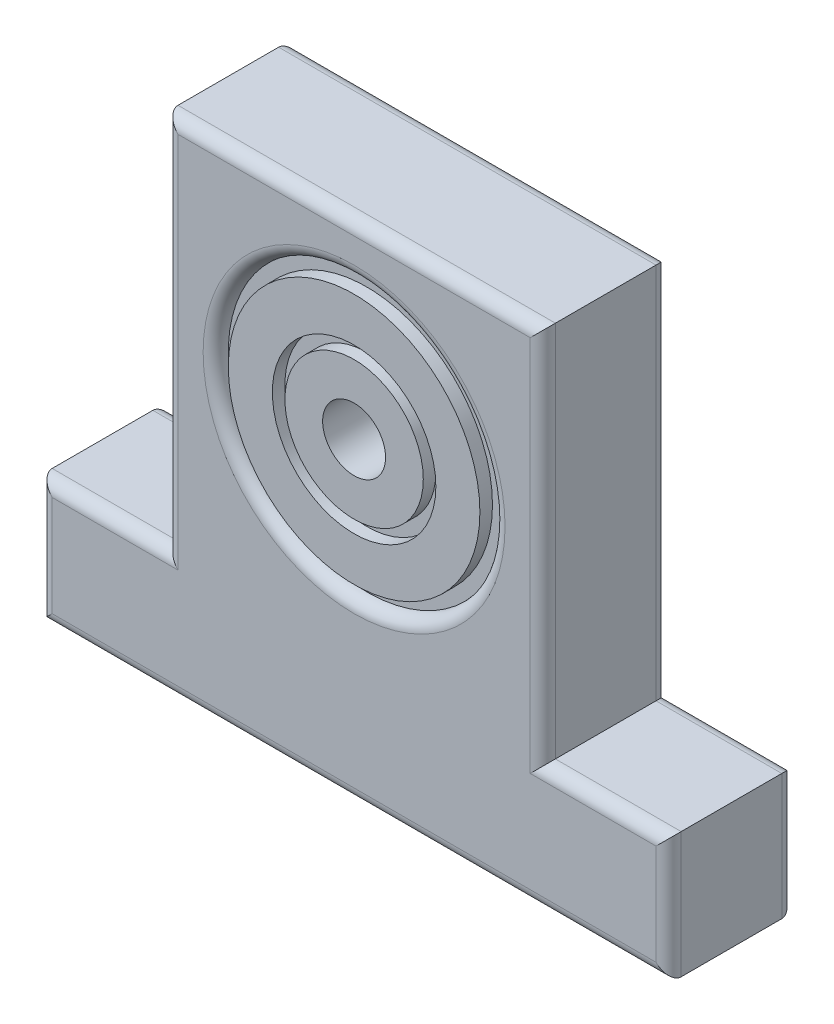
ISO-10303-21;
HEADER;
FILE_DESCRIPTION(('STEP AP214'),'2;1');
FILE_NAME('part.step','',(''),(''),'','','');
FILE_SCHEMA(('AUTOMOTIVE_DESIGN { 1 0 10303 214 1 1 1 1 }'));
ENDSEC;
DATA;
#1=APPLICATION_CONTEXT('core data for automotive mechanical design processes');
#2=APPLICATION_PROTOCOL_DEFINITION('international standard','automotive_design',2000,#1);
#3=PRODUCT_CONTEXT('',#1,'mechanical');
#4=PRODUCT('Part','Part','',(#3));
#5=PRODUCT_RELATED_PRODUCT_CATEGORY('part','',(#4));
#6=PRODUCT_DEFINITION_FORMATION('','',#4);
#7=PRODUCT_DEFINITION_CONTEXT('part definition',#1,'design');
#8=PRODUCT_DEFINITION('design','',#6,#7);
#9=PRODUCT_DEFINITION_SHAPE('','',#8);
#10=(LENGTH_UNIT() NAMED_UNIT(*) SI_UNIT(.MILLI.,.METRE.));
#11=(NAMED_UNIT(*) PLANE_ANGLE_UNIT() SI_UNIT($,.RADIAN.));
#12=(NAMED_UNIT(*) SI_UNIT($,.STERADIAN.) SOLID_ANGLE_UNIT());
#13=UNCERTAINTY_MEASURE_WITH_UNIT(LENGTH_MEASURE(1.E-05),#10,'distance_accuracy_value','');
#14=(GEOMETRIC_REPRESENTATION_CONTEXT(3) GLOBAL_UNCERTAINTY_ASSIGNED_CONTEXT((#13)) GLOBAL_UNIT_ASSIGNED_CONTEXT((#10,
#11,#12)) REPRESENTATION_CONTEXT('',''));
#15=CARTESIAN_POINT('',(0.,0.,0.));
#16=DIRECTION('',(0.,0.,1.));
#17=DIRECTION('',(1.,0.,0.));
#18=AXIS2_PLACEMENT_3D('',#15,#16,#17);
#19=CARTESIAN_POINT('',(0.,0.,0.));
#20=DIRECTION('',(0.,0.,1.));
#21=DIRECTION('',(1.,0.,0.));
#22=AXIS2_PLACEMENT_3D('',#19,#20,#21);
#23=PLANE('',#22);
#24=CARTESIAN_POINT('',(25.,25.,0.));
#25=DIRECTION('',(0.,0.,1.));
#26=DIRECTION('',(1.,0.,0.));
#27=AXIS2_PLACEMENT_3D('',#24,#25,#26);
#28=CIRCLE('',#27,2.5);
#29=CARTESIAN_POINT('',(27.5,25.,0.));
#30=VERTEX_POINT('',#29);
#31=EDGE_CURVE('E418',#30,#30,#28,.T.);
#32=ORIENTED_EDGE('',*,*,#31,.T.);
#33=EDGE_LOOP('',(#32));
#34=FACE_BOUND('',#33,.T.);
#35=CARTESIAN_POINT('',(25.,25.,0.));
#36=DIRECTION('',(0.,0.,1.));
#37=DIRECTION('',(1.,0.,0.));
#38=AXIS2_PLACEMENT_3D('',#35,#36,#37);
#39=CIRCLE('',#38,5.5);
#40=CARTESIAN_POINT('',(30.5,25.,0.));
#41=VERTEX_POINT('',#40);
#42=EDGE_CURVE('E459',#41,#41,#39,.T.);
#43=ORIENTED_EDGE('',*,*,#42,.F.);
#44=EDGE_LOOP('',(#43));
#45=FACE_BOUND('',#44,.T.);
#46=ADVANCED_FACE('F77',(#34,#45),#23,.F.);
#47=CARTESIAN_POINT('',(0.,0.,10.));
#48=DIRECTION('',(0.,0.,1.));
#49=DIRECTION('',(1.,0.,0.));
#50=AXIS2_PLACEMENT_3D('',#47,#48,#49);
#51=PLANE('',#50);
#52=CARTESIAN_POINT('',(25.,25.,10.));
#53=DIRECTION('',(0.,0.,1.));
#54=DIRECTION('',(1.,0.,0.));
#55=AXIS2_PLACEMENT_3D('',#52,#53,#54);
#56=CIRCLE('',#55,2.5);
#57=CARTESIAN_POINT('',(27.5,25.,10.));
#58=VERTEX_POINT('',#57);
#59=EDGE_CURVE('E417',#58,#58,#56,.T.);
#60=ORIENTED_EDGE('',*,*,#59,.F.);
#61=EDGE_LOOP('',(#60));
#62=FACE_BOUND('',#61,.T.);
#63=CARTESIAN_POINT('',(25.,25.,10.));
#64=DIRECTION('',(0.,0.,1.));
#65=DIRECTION('',(1.,0.,0.));
#66=AXIS2_PLACEMENT_3D('',#63,#64,#65);
#67=CIRCLE('',#66,5.5);
#68=CARTESIAN_POINT('',(30.5,25.,10.));
#69=VERTEX_POINT('',#68);
#70=EDGE_CURVE('E431',#69,#69,#67,.T.);
#71=ORIENTED_EDGE('',*,*,#70,.T.);
#72=EDGE_LOOP('',(#71));
#73=FACE_BOUND('',#72,.T.);
#74=ADVANCED_FACE('F508',(#62,#73),#51,.T.);
#75=DIRECTION('',(0.,-1.,0.));
#76=VECTOR('',#75,1.);
#77=CARTESIAN_POINT('',(11.,9.99999999999999,10.));
#78=LINE('',#77,#76);
#79=CARTESIAN_POINT('',(11.,39.,10.));
#80=VERTEX_POINT('',#79);
#81=CARTESIAN_POINT('',(11.,8.99999999999999,10.));
#82=VERTEX_POINT('',#81);
#83=EDGE_CURVE('E87',#80,#82,#78,.T.);
#84=ORIENTED_EDGE('',*,*,#83,.T.);
#85=DIRECTION('',(-1.,0.,0.));
#86=VECTOR('',#85,1.);
#87=CARTESIAN_POINT('',(0.,8.99999999999999,10.));
#88=LINE('',#87,#86);
#89=CARTESIAN_POINT('',(1.,8.99999999999999,10.));
#90=VERTEX_POINT('',#89);
#91=EDGE_CURVE('E12',#82,#90,#88,.T.);
#92=ORIENTED_EDGE('',*,*,#91,.T.);
#93=DIRECTION('',(0.,-1.,0.));
#94=VECTOR('',#93,1.);
#95=CARTESIAN_POINT('',(1.,0.,10.));
#96=LINE('',#95,#94);
#97=CARTESIAN_POINT('',(1.,1.,10.));
#98=VERTEX_POINT('',#97);
#99=EDGE_CURVE('E312',#90,#98,#96,.T.);
#100=ORIENTED_EDGE('',*,*,#99,.T.);
#101=DIRECTION('',(1.,0.,0.));
#102=VECTOR('',#101,1.);
#103=CARTESIAN_POINT('',(50.,1.,10.));
#104=LINE('',#103,#102);
#105=CARTESIAN_POINT('',(49.,1.,10.));
#106=VERTEX_POINT('',#105);
#107=EDGE_CURVE('E315',#98,#106,#104,.T.);
#108=ORIENTED_EDGE('',*,*,#107,.T.);
#109=DIRECTION('',(0.,1.,0.));
#110=VECTOR('',#109,1.);
#111=CARTESIAN_POINT('',(49.,10.,10.));
#112=LINE('',#111,#110);
#113=CARTESIAN_POINT('',(49.,9.,10.));
#114=VERTEX_POINT('',#113);
#115=EDGE_CURVE('E222',#106,#114,#112,.T.);
#116=ORIENTED_EDGE('',*,*,#115,.T.);
#117=DIRECTION('',(-1.,0.,0.));
#118=VECTOR('',#117,1.);
#119=CARTESIAN_POINT('',(40.,9.,10.));
#120=LINE('',#119,#118);
#121=CARTESIAN_POINT('',(39.,9.,10.));
#122=VERTEX_POINT('',#121);
#123=EDGE_CURVE('E320',#114,#122,#120,.T.);
#124=ORIENTED_EDGE('',*,*,#123,.T.);
#125=DIRECTION('',(0.,1.,0.));
#126=VECTOR('',#125,1.);
#127=CARTESIAN_POINT('',(39.,40.,10.));
#128=LINE('',#127,#126);
#129=CARTESIAN_POINT('',(39.,39.,10.));
#130=VERTEX_POINT('',#129);
#131=EDGE_CURVE('E323',#122,#130,#128,.T.);
#132=ORIENTED_EDGE('',*,*,#131,.T.);
#133=DIRECTION('',(-1.,0.,0.));
#134=VECTOR('',#133,1.);
#135=CARTESIAN_POINT('',(9.99999999999999,39.,10.));
#136=LINE('',#135,#134);
#137=EDGE_CURVE('E98',#130,#80,#136,.T.);
#138=ORIENTED_EDGE('',*,*,#137,.T.);
#139=EDGE_LOOP('',(#84,#92,#100,#108,#116,#124,#132,#138));
#140=FACE_BOUND('',#139,.T.);
#141=CARTESIAN_POINT('',(25.,25.,10.));
#142=DIRECTION('',(0.,0.,1.));
#143=DIRECTION('',(1.,0.,0.));
#144=AXIS2_PLACEMENT_3D('',#141,#142,#143);
#145=CIRCLE('',#144,12.);
#146=CARTESIAN_POINT('',(37.,25.,10.));
#147=VERTEX_POINT('',#146);
#148=EDGE_CURVE('E308',#147,#147,#145,.F.);
#149=ORIENTED_EDGE('',*,*,#148,.T.);
#150=EDGE_LOOP('',(#149));
#151=FACE_BOUND('',#150,.T.);
#152=ADVANCED_FACE('F512',(#140,#151),#51,.T.);
#153=DIRECTION('',(0.,1.,0.));
#154=VECTOR('',#153,1.);
#155=CARTESIAN_POINT('',(49.,0.,0.));
#156=LINE('',#155,#154);
#157=CARTESIAN_POINT('',(49.,9.,0.));
#158=VERTEX_POINT('',#157);
#159=CARTESIAN_POINT('',(49.,1.,0.));
#160=VERTEX_POINT('',#159);
#161=EDGE_CURVE('E263',#158,#160,#156,.F.);
#162=ORIENTED_EDGE('',*,*,#161,.T.);
#163=DIRECTION('',(1.,0.,0.));
#164=VECTOR('',#163,1.);
#165=CARTESIAN_POINT('',(0.,1.,0.));
#166=LINE('',#165,#164);
#167=CARTESIAN_POINT('',(1.,1.,0.));
#168=VERTEX_POINT('',#167);
#169=EDGE_CURVE('E204',#160,#168,#166,.F.);
#170=ORIENTED_EDGE('',*,*,#169,.T.);
#171=DIRECTION('',(0.,-1.,0.));
#172=VECTOR('',#171,1.);
#173=CARTESIAN_POINT('',(1.,0.,0.));
#174=LINE('',#173,#172);
#175=CARTESIAN_POINT('',(1.,8.99999999999999,0.));
#176=VERTEX_POINT('',#175);
#177=EDGE_CURVE('E245',#168,#176,#174,.F.);
#178=ORIENTED_EDGE('',*,*,#177,.T.);
#179=DIRECTION('',(-1.,0.,0.));
#180=VECTOR('',#179,1.);
#181=CARTESIAN_POINT('',(0.,8.99999999999999,0.));
#182=LINE('',#181,#180);
#183=CARTESIAN_POINT('',(11.,8.99999999999999,0.));
#184=VERTEX_POINT('',#183);
#185=EDGE_CURVE('E248',#176,#184,#182,.F.);
#186=ORIENTED_EDGE('',*,*,#185,.T.);
#187=DIRECTION('',(0.,-1.,0.));
#188=VECTOR('',#187,1.);
#189=CARTESIAN_POINT('',(11.,0.,0.));
#190=LINE('',#189,#188);
#191=CARTESIAN_POINT('',(11.,39.,0.));
#192=VERTEX_POINT('',#191);
#193=EDGE_CURVE('E251',#184,#192,#190,.F.);
#194=ORIENTED_EDGE('',*,*,#193,.T.);
#195=DIRECTION('',(-1.,0.,0.));
#196=VECTOR('',#195,1.);
#197=CARTESIAN_POINT('',(0.,39.,0.));
#198=LINE('',#197,#196);
#199=CARTESIAN_POINT('',(39.,39.,0.));
#200=VERTEX_POINT('',#199);
#201=EDGE_CURVE('E254',#192,#200,#198,.F.);
#202=ORIENTED_EDGE('',*,*,#201,.T.);
#203=DIRECTION('',(0.,1.,0.));
#204=VECTOR('',#203,1.);
#205=CARTESIAN_POINT('',(39.,0.,0.));
#206=LINE('',#205,#204);
#207=CARTESIAN_POINT('',(39.,9.,0.));
#208=VERTEX_POINT('',#207);
#209=EDGE_CURVE('E257',#200,#208,#206,.F.);
#210=ORIENTED_EDGE('',*,*,#209,.T.);
#211=DIRECTION('',(-1.,0.,0.));
#212=VECTOR('',#211,1.);
#213=CARTESIAN_POINT('',(0.,8.99999999999999,0.));
#214=LINE('',#213,#212);
#215=EDGE_CURVE('E260',#208,#158,#214,.F.);
#216=ORIENTED_EDGE('',*,*,#215,.T.);
#217=EDGE_LOOP('',(#162,#170,#178,#186,#194,#202,#210,#216));
#218=FACE_BOUND('',#217,.T.);
#219=CARTESIAN_POINT('',(25.,25.,0.));
#220=DIRECTION('',(0.,0.,1.));
#221=DIRECTION('',(1.,0.,0.));
#222=AXIS2_PLACEMENT_3D('',#219,#220,#221);
#223=CIRCLE('',#222,12.);
#224=CARTESIAN_POINT('',(37.,25.,0.));
#225=VERTEX_POINT('',#224);
#226=EDGE_CURVE('E238',#225,#225,#223,.T.);
#227=ORIENTED_EDGE('',*,*,#226,.T.);
#228=EDGE_LOOP('',(#227));
#229=FACE_BOUND('',#228,.T.);
#230=ADVANCED_FACE('F496',(#218,#229),#23,.F.);
#231=CARTESIAN_POINT('',(0.,9.99999999999999,10.));
#232=DIRECTION('',(1.,0.,0.));
#233=DIRECTION('',(0.,0.,-1.));
#234=AXIS2_PLACEMENT_3D('',#231,#232,#233);
#235=PLANE('',#234);
#236=DIRECTION('',(0.,0.,-1.));
#237=VECTOR('',#236,1.);
#238=CARTESIAN_POINT('',(0.,9.99999999999999,10.));
#239=LINE('',#238,#237);
#240=CARTESIAN_POINT('',(0.,9.99999999999999,9.));
#241=VERTEX_POINT('',#240);
#242=CARTESIAN_POINT('',(0.,9.99999999999999,0.999999999999999));
#243=VERTEX_POINT('',#242);
#244=EDGE_CURVE('E413',#241,#243,#239,.T.);
#245=ORIENTED_EDGE('',*,*,#244,.T.);
#246=DIRECTION('',(0.,-1.,0.));
#247=VECTOR('',#246,1.);
#248=CARTESIAN_POINT('',(0.,9.99999999999999,0.999999999999999));
#249=LINE('',#248,#247);
#250=CARTESIAN_POINT('',(0.,0.,0.999999999999999));
#251=VERTEX_POINT('',#250);
#252=EDGE_CURVE('E305',#243,#251,#249,.T.);
#253=ORIENTED_EDGE('',*,*,#252,.T.);
#254=DIRECTION('',(0.,0.,-1.));
#255=VECTOR('',#254,1.);
#256=CARTESIAN_POINT('',(0.,0.,10.));
#257=LINE('',#256,#255);
#258=CARTESIAN_POINT('',(0.,0.,9.));
#259=VERTEX_POINT('',#258);
#260=EDGE_CURVE('E216',#259,#251,#257,.T.);
#261=ORIENTED_EDGE('',*,*,#260,.F.);
#262=DIRECTION('',(0.,-1.,0.));
#263=VECTOR('',#262,1.);
#264=CARTESIAN_POINT('',(0.,9.99999999999999,9.));
#265=LINE('',#264,#263);
#266=EDGE_CURVE('E302',#259,#241,#265,.F.);
#267=ORIENTED_EDGE('',*,*,#266,.T.);
#268=EDGE_LOOP('',(#245,#253,#261,#267));
#269=FACE_BOUND('',#268,.T.);
#270=ADVANCED_FACE('F511',(#269),#235,.F.);
#271=CARTESIAN_POINT('',(0.,0.,10.));
#272=DIRECTION('',(0.,1.,0.));
#273=DIRECTION('',(0.,0.,1.));
#274=AXIS2_PLACEMENT_3D('',#271,#272,#273);
#275=PLANE('',#274);
#276=ORIENTED_EDGE('',*,*,#260,.T.);
#277=DIRECTION('',(1.,0.,0.));
#278=VECTOR('',#277,1.);
#279=CARTESIAN_POINT('',(0.,0.,0.999999999999999));
#280=LINE('',#279,#278);
#281=CARTESIAN_POINT('',(50.,0.,0.999999999999999));
#282=VERTEX_POINT('',#281);
#283=EDGE_CURVE('E214',#251,#282,#280,.T.);
#284=ORIENTED_EDGE('',*,*,#283,.T.);
#285=DIRECTION('',(0.,0.,-1.));
#286=VECTOR('',#285,1.);
#287=CARTESIAN_POINT('',(50.,0.,10.));
#288=LINE('',#287,#286);
#289=CARTESIAN_POINT('',(50.,0.,9.));
#290=VERTEX_POINT('',#289);
#291=EDGE_CURVE('E195',#290,#282,#288,.T.);
#292=ORIENTED_EDGE('',*,*,#291,.F.);
#293=DIRECTION('',(1.,0.,0.));
#294=VECTOR('',#293,1.);
#295=CARTESIAN_POINT('',(0.,0.,9.));
#296=LINE('',#295,#294);
#297=EDGE_CURVE('E211',#290,#259,#296,.F.);
#298=ORIENTED_EDGE('',*,*,#297,.T.);
#299=EDGE_LOOP('',(#276,#284,#292,#298));
#300=FACE_BOUND('',#299,.T.);
#301=ADVANCED_FACE('F209',(#300),#275,.F.);
#302=CARTESIAN_POINT('',(50.,0.,10.));
#303=DIRECTION('',(-1.,0.,0.));
#304=DIRECTION('',(0.,0.,1.));
#305=AXIS2_PLACEMENT_3D('',#302,#303,#304);
#306=PLANE('',#305);
#307=ORIENTED_EDGE('',*,*,#291,.T.);
#308=DIRECTION('',(0.,1.,0.));
#309=VECTOR('',#308,1.);
#310=CARTESIAN_POINT('',(50.,0.,0.999999999999999));
#311=LINE('',#310,#309);
#312=CARTESIAN_POINT('',(50.,10.,0.999999999999999));
#313=VERTEX_POINT('',#312);
#314=EDGE_CURVE('E203',#282,#313,#311,.T.);
#315=ORIENTED_EDGE('',*,*,#314,.T.);
#316=DIRECTION('',(0.,0.,-1.));
#317=VECTOR('',#316,1.);
#318=CARTESIAN_POINT('',(50.,10.,10.));
#319=LINE('',#318,#317);
#320=CARTESIAN_POINT('',(50.,10.,9.));
#321=VERTEX_POINT('',#320);
#322=EDGE_CURVE('E197',#321,#313,#319,.T.);
#323=ORIENTED_EDGE('',*,*,#322,.F.);
#324=DIRECTION('',(0.,1.,0.));
#325=VECTOR('',#324,1.);
#326=CARTESIAN_POINT('',(50.,0.,9.));
#327=LINE('',#326,#325);
#328=EDGE_CURVE('E192',#321,#290,#327,.F.);
#329=ORIENTED_EDGE('',*,*,#328,.T.);
#330=EDGE_LOOP('',(#307,#315,#323,#329));
#331=FACE_BOUND('',#330,.T.);
#332=ADVANCED_FACE('F194',(#331),#306,.F.);
#333=CARTESIAN_POINT('',(50.,10.,10.));
#334=DIRECTION('',(0.,-1.,0.));
#335=DIRECTION('',(1.,0.,0.));
#336=AXIS2_PLACEMENT_3D('',#333,#334,#335);
#337=PLANE('',#336);
#338=ORIENTED_EDGE('',*,*,#322,.T.);
#339=DIRECTION('',(-1.,0.,0.));
#340=VECTOR('',#339,1.);
#341=CARTESIAN_POINT('',(50.,10.,0.999999999999999));
#342=LINE('',#341,#340);
#343=CARTESIAN_POINT('',(40.,10.,0.999999999999999));
#344=VERTEX_POINT('',#343);
#345=EDGE_CURVE('E274',#313,#344,#342,.T.);
#346=ORIENTED_EDGE('',*,*,#345,.T.);
#347=DIRECTION('',(0.,0.,-1.));
#348=VECTOR('',#347,1.);
#349=CARTESIAN_POINT('',(40.,10.,10.));
#350=LINE('',#349,#348);
#351=CARTESIAN_POINT('',(40.,10.,9.));
#352=VERTEX_POINT('',#351);
#353=EDGE_CURVE('E393',#352,#344,#350,.T.);
#354=ORIENTED_EDGE('',*,*,#353,.F.);
#355=DIRECTION('',(-1.,0.,0.));
#356=VECTOR('',#355,1.);
#357=CARTESIAN_POINT('',(50.,10.,9.));
#358=LINE('',#357,#356);
#359=EDGE_CURVE('E271',#352,#321,#358,.F.);
#360=ORIENTED_EDGE('',*,*,#359,.T.);
#361=EDGE_LOOP('',(#338,#346,#354,#360));
#362=FACE_BOUND('',#361,.T.);
#363=ADVANCED_FACE('F390',(#362),#337,.F.);
#364=CARTESIAN_POINT('',(40.,10.,10.));
#365=DIRECTION('',(-1.,0.,0.));
#366=DIRECTION('',(0.,-1.,0.));
#367=AXIS2_PLACEMENT_3D('',#364,#365,#366);
#368=PLANE('',#367);
#369=ORIENTED_EDGE('',*,*,#353,.T.);
#370=DIRECTION('',(0.,1.,0.));
#371=VECTOR('',#370,1.);
#372=CARTESIAN_POINT('',(40.,10.,0.999999999999999));
#373=LINE('',#372,#371);
#374=CARTESIAN_POINT('',(40.,40.,0.999999999999999));
#375=VERTEX_POINT('',#374);
#376=EDGE_CURVE('E280',#344,#375,#373,.T.);
#377=ORIENTED_EDGE('',*,*,#376,.T.);
#378=DIRECTION('',(0.,0.,-1.));
#379=VECTOR('',#378,1.);
#380=CARTESIAN_POINT('',(40.,40.,10.));
#381=LINE('',#380,#379);
#382=CARTESIAN_POINT('',(40.,40.,9.));
#383=VERTEX_POINT('',#382);
#384=EDGE_CURVE('E397',#383,#375,#381,.T.);
#385=ORIENTED_EDGE('',*,*,#384,.F.);
#386=DIRECTION('',(0.,1.,0.));
#387=VECTOR('',#386,1.);
#388=CARTESIAN_POINT('',(40.,10.,9.));
#389=LINE('',#388,#387);
#390=EDGE_CURVE('E277',#383,#352,#389,.F.);
#391=ORIENTED_EDGE('',*,*,#390,.T.);
#392=EDGE_LOOP('',(#369,#377,#385,#391));
#393=FACE_BOUND('',#392,.T.);
#394=ADVANCED_FACE('F819',(#393),#368,.F.);
#395=CARTESIAN_POINT('',(40.,40.,10.));
#396=DIRECTION('',(0.,-1.,0.));
#397=DIRECTION('',(1.,0.,0.));
#398=AXIS2_PLACEMENT_3D('',#395,#396,#397);
#399=PLANE('',#398);
#400=ORIENTED_EDGE('',*,*,#384,.T.);
#401=DIRECTION('',(-1.,0.,0.));
#402=VECTOR('',#401,1.);
#403=CARTESIAN_POINT('',(40.,40.,0.999999999999999));
#404=LINE('',#403,#402);
#405=CARTESIAN_POINT('',(9.99999999999999,40.,0.999999999999999));
#406=VERTEX_POINT('',#405);
#407=EDGE_CURVE('E286',#375,#406,#404,.T.);
#408=ORIENTED_EDGE('',*,*,#407,.T.);
#409=DIRECTION('',(0.,0.,-1.));
#410=VECTOR('',#409,1.);
#411=CARTESIAN_POINT('',(9.99999999999999,40.,10.));
#412=LINE('',#411,#410);
#413=CARTESIAN_POINT('',(9.99999999999999,40.,9.));
#414=VERTEX_POINT('',#413);
#415=EDGE_CURVE('E403',#414,#406,#412,.T.);
#416=ORIENTED_EDGE('',*,*,#415,.F.);
#417=DIRECTION('',(-1.,0.,0.));
#418=VECTOR('',#417,1.);
#419=CARTESIAN_POINT('',(40.,40.,9.));
#420=LINE('',#419,#418);
#421=EDGE_CURVE('E283',#414,#383,#420,.F.);
#422=ORIENTED_EDGE('',*,*,#421,.T.);
#423=EDGE_LOOP('',(#400,#408,#416,#422));
#424=FACE_BOUND('',#423,.T.);
#425=ADVANCED_FACE('F810',(#424),#399,.F.);
#426=CARTESIAN_POINT('',(9.99999999999999,40.,10.));
#427=DIRECTION('',(1.,0.,0.));
#428=DIRECTION('',(0.,1.,0.));
#429=AXIS2_PLACEMENT_3D('',#426,#427,#428);
#430=PLANE('',#429);
#431=ORIENTED_EDGE('',*,*,#415,.T.);
#432=DIRECTION('',(0.,-1.,0.));
#433=VECTOR('',#432,1.);
#434=CARTESIAN_POINT('',(9.99999999999999,40.,0.999999999999999));
#435=LINE('',#434,#433);
#436=CARTESIAN_POINT('',(10.,9.99999999999999,0.999999999999999));
#437=VERTEX_POINT('',#436);
#438=EDGE_CURVE('E292',#406,#437,#435,.T.);
#439=ORIENTED_EDGE('',*,*,#438,.T.);
#440=DIRECTION('',(0.,0.,-1.));
#441=VECTOR('',#440,1.);
#442=CARTESIAN_POINT('',(10.,9.99999999999999,10.));
#443=LINE('',#442,#441);
#444=CARTESIAN_POINT('',(10.,9.99999999999999,9.));
#445=VERTEX_POINT('',#444);
#446=EDGE_CURVE('E409',#445,#437,#443,.T.);
#447=ORIENTED_EDGE('',*,*,#446,.F.);
#448=DIRECTION('',(0.,-1.,0.));
#449=VECTOR('',#448,1.);
#450=CARTESIAN_POINT('',(9.99999999999999,40.,9.));
#451=LINE('',#450,#449);
#452=EDGE_CURVE('E289',#445,#414,#451,.F.);
#453=ORIENTED_EDGE('',*,*,#452,.T.);
#454=EDGE_LOOP('',(#431,#439,#447,#453));
#455=FACE_BOUND('',#454,.T.);
#456=ADVANCED_FACE('F802',(#455),#430,.F.);
#457=CARTESIAN_POINT('',(10.,9.99999999999999,10.));
#458=DIRECTION('',(0.,-1.,0.));
#459=DIRECTION('',(1.,0.,0.));
#460=AXIS2_PLACEMENT_3D('',#457,#458,#459);
#461=PLANE('',#460);
#462=ORIENTED_EDGE('',*,*,#446,.T.);
#463=DIRECTION('',(-1.,0.,0.));
#464=VECTOR('',#463,1.);
#465=CARTESIAN_POINT('',(10.,9.99999999999999,0.999999999999999));
#466=LINE('',#465,#464);
#467=EDGE_CURVE('E299',#437,#243,#466,.T.);
#468=ORIENTED_EDGE('',*,*,#467,.T.);
#469=ORIENTED_EDGE('',*,*,#244,.F.);
#470=DIRECTION('',(-1.,0.,0.));
#471=VECTOR('',#470,1.);
#472=CARTESIAN_POINT('',(10.,9.99999999999999,9.));
#473=LINE('',#472,#471);
#474=EDGE_CURVE('E295',#241,#445,#473,.F.);
#475=ORIENTED_EDGE('',*,*,#474,.T.);
#476=EDGE_LOOP('',(#462,#468,#469,#475));
#477=FACE_BOUND('',#476,.T.);
#478=ADVANCED_FACE('F794',(#477),#461,.F.);
#479=CARTESIAN_POINT('',(25.,25.,10.));
#480=DIRECTION('',(0.,0.,-1.));
#481=DIRECTION('',(-1.,0.,0.));
#482=AXIS2_PLACEMENT_3D('',#479,#480,#481);
#483=CYLINDRICAL_SURFACE('',#482,2.5);
#484=ORIENTED_EDGE('',*,*,#59,.T.);
#485=EDGE_LOOP('',(#484));
#486=FACE_BOUND('',#485,.T.);
#487=ORIENTED_EDGE('',*,*,#31,.F.);
#488=EDGE_LOOP('',(#487));
#489=FACE_BOUND('',#488,.T.);
#490=ADVANCED_FACE('F772',(#486,#489),#483,.F.);
#491=CARTESIAN_POINT('',(25.,25.,9.));
#492=DIRECTION('',(0.,0.,1.));
#493=DIRECTION('',(1.,0.,0.));
#494=AXIS2_PLACEMENT_3D('',#491,#492,#493);
#495=CYLINDRICAL_SURFACE('',#494,5.5);
#496=CARTESIAN_POINT('',(25.,25.,9.));
#497=DIRECTION('',(0.,0.,1.));
#498=DIRECTION('',(1.,0.,0.));
#499=AXIS2_PLACEMENT_3D('',#496,#497,#498);
#500=CIRCLE('',#499,5.5);
#501=CARTESIAN_POINT('',(30.5,25.,9.));
#502=VERTEX_POINT('',#501);
#503=EDGE_CURVE('E430',#502,#502,#500,.T.);
#504=ORIENTED_EDGE('',*,*,#503,.T.);
#505=EDGE_LOOP('',(#504));
#506=FACE_BOUND('',#505,.T.);
#507=ORIENTED_EDGE('',*,*,#70,.F.);
#508=EDGE_LOOP('',(#507));
#509=FACE_BOUND('',#508,.T.);
#510=ADVANCED_FACE('F763',(#506,#509),#495,.T.);
#511=CARTESIAN_POINT('',(25.,25.,9.));
#512=DIRECTION('',(0.,0.,1.));
#513=DIRECTION('',(1.,0.,0.));
#514=AXIS2_PLACEMENT_3D('',#511,#512,#513);
#515=CYLINDRICAL_SURFACE('',#514,6.5);
#516=CARTESIAN_POINT('',(25.,25.,9.));
#517=DIRECTION('',(0.,0.,1.));
#518=DIRECTION('',(1.,0.,0.));
#519=AXIS2_PLACEMENT_3D('',#516,#517,#518);
#520=CIRCLE('',#519,6.5);
#521=CARTESIAN_POINT('',(31.5,25.,9.));
#522=VERTEX_POINT('',#521);
#523=EDGE_CURVE('E422',#522,#522,#520,.T.);
#524=ORIENTED_EDGE('',*,*,#523,.F.);
#525=EDGE_LOOP('',(#524));
#526=FACE_BOUND('',#525,.T.);
#527=CARTESIAN_POINT('',(25.,25.,10.));
#528=DIRECTION('',(0.,0.,1.));
#529=DIRECTION('',(1.,0.,0.));
#530=AXIS2_PLACEMENT_3D('',#527,#528,#529);
#531=CIRCLE('',#530,6.5);
#532=CARTESIAN_POINT('',(31.5,25.,10.));
#533=VERTEX_POINT('',#532);
#534=EDGE_CURVE('E426',#533,#533,#531,.T.);
#535=ORIENTED_EDGE('',*,*,#534,.T.);
#536=EDGE_LOOP('',(#535));
#537=FACE_BOUND('',#536,.T.);
#538=ADVANCED_FACE('F754',(#526,#537),#515,.F.);
#539=CARTESIAN_POINT('',(0.,0.,9.));
#540=DIRECTION('',(0.,0.,1.));
#541=DIRECTION('',(1.,0.,0.));
#542=AXIS2_PLACEMENT_3D('',#539,#540,#541);
#543=PLANE('',#542);
#544=ORIENTED_EDGE('',*,*,#503,.F.);
#545=EDGE_LOOP('',(#544));
#546=FACE_BOUND('',#545,.T.);
#547=ORIENTED_EDGE('',*,*,#523,.T.);
#548=EDGE_LOOP('',(#547));
#549=FACE_BOUND('',#548,.T.);
#550=ADVANCED_FACE('F745',(#546,#549),#543,.T.);
#551=CARTESIAN_POINT('',(25.,25.,9.));
#552=DIRECTION('',(0.,0.,1.));
#553=DIRECTION('',(1.,0.,0.));
#554=AXIS2_PLACEMENT_3D('',#551,#552,#553);
#555=CYLINDRICAL_SURFACE('',#554,10.);
#556=CARTESIAN_POINT('',(25.,25.,9.));
#557=DIRECTION('',(0.,0.,1.));
#558=DIRECTION('',(1.,0.,0.));
#559=AXIS2_PLACEMENT_3D('',#556,#557,#558);
#560=CIRCLE('',#559,10.);
#561=CARTESIAN_POINT('',(35.,25.,9.));
#562=VERTEX_POINT('',#561);
#563=EDGE_CURVE('E446',#562,#562,#560,.T.);
#564=ORIENTED_EDGE('',*,*,#563,.T.);
#565=EDGE_LOOP('',(#564));
#566=FACE_BOUND('',#565,.T.);
#567=CARTESIAN_POINT('',(25.,25.,10.));
#568=DIRECTION('',(0.,0.,1.));
#569=DIRECTION('',(1.,0.,0.));
#570=AXIS2_PLACEMENT_3D('',#567,#568,#569);
#571=CIRCLE('',#570,10.);
#572=CARTESIAN_POINT('',(35.,25.,10.));
#573=VERTEX_POINT('',#572);
#574=EDGE_CURVE('E442',#573,#573,#571,.T.);
#575=ORIENTED_EDGE('',*,*,#574,.F.);
#576=EDGE_LOOP('',(#575));
#577=FACE_BOUND('',#576,.T.);
#578=ADVANCED_FACE('F736',(#566,#577),#555,.T.);
#579=CARTESIAN_POINT('',(0.,0.,9.));
#580=DIRECTION('',(0.,0.,1.));
#581=DIRECTION('',(1.,0.,0.));
#582=AXIS2_PLACEMENT_3D('',#579,#580,#581);
#583=PLANE('',#582);
#584=ORIENTED_EDGE('',*,*,#563,.F.);
#585=EDGE_LOOP('',(#584));
#586=FACE_BOUND('',#585,.T.);
#587=CARTESIAN_POINT('',(25.,25.,9.));
#588=DIRECTION('',(0.,0.,1.));
#589=DIRECTION('',(1.,0.,0.));
#590=AXIS2_PLACEMENT_3D('',#587,#588,#589);
#591=CIRCLE('',#590,11.);
#592=CARTESIAN_POINT('',(36.,25.,9.));
#593=VERTEX_POINT('',#592);
#594=EDGE_CURVE('E435',#593,#593,#591,.T.);
#595=ORIENTED_EDGE('',*,*,#594,.T.);
#596=EDGE_LOOP('',(#595));
#597=FACE_BOUND('',#596,.T.);
#598=ADVANCED_FACE('F730',(#586,#597),#583,.T.);
#599=ORIENTED_EDGE('',*,*,#534,.F.);
#600=EDGE_LOOP('',(#599));
#601=FACE_BOUND('',#600,.T.);
#602=ORIENTED_EDGE('',*,*,#574,.T.);
#603=EDGE_LOOP('',(#602));
#604=FACE_BOUND('',#603,.T.);
#605=ADVANCED_FACE('F520',(#601,#604),#51,.T.);
#606=CARTESIAN_POINT('',(25.,25.,1.));
#607=DIRECTION('',(0.,0.,-1.));
#608=DIRECTION('',(-1.,0.,0.));
#609=AXIS2_PLACEMENT_3D('',#606,#607,#608);
#610=CYLINDRICAL_SURFACE('',#609,5.5);
#611=CARTESIAN_POINT('',(25.,25.,1.));
#612=DIRECTION('',(0.,0.,1.));
#613=DIRECTION('',(1.,0.,0.));
#614=AXIS2_PLACEMENT_3D('',#611,#612,#613);
#615=CIRCLE('',#614,5.5);
#616=CARTESIAN_POINT('',(30.5,25.,1.));
#617=VERTEX_POINT('',#616);
#618=EDGE_CURVE('E458',#617,#617,#615,.T.);
#619=ORIENTED_EDGE('',*,*,#618,.F.);
#620=EDGE_LOOP('',(#619));
#621=FACE_BOUND('',#620,.T.);
#622=ORIENTED_EDGE('',*,*,#42,.T.);
#623=EDGE_LOOP('',(#622));
#624=FACE_BOUND('',#623,.T.);
#625=ADVANCED_FACE('F708',(#621,#624),#610,.T.);
#626=CARTESIAN_POINT('',(25.,25.,1.));
#627=DIRECTION('',(0.,0.,-1.));
#628=DIRECTION('',(-1.,0.,0.));
#629=AXIS2_PLACEMENT_3D('',#626,#627,#628);
#630=CYLINDRICAL_SURFACE('',#629,6.5);
#631=CARTESIAN_POINT('',(25.,25.,1.));
#632=DIRECTION('',(0.,0.,1.));
#633=DIRECTION('',(1.,0.,0.));
#634=AXIS2_PLACEMENT_3D('',#631,#632,#633);
#635=CIRCLE('',#634,6.5);
#636=CARTESIAN_POINT('',(31.5,25.,1.));
#637=VERTEX_POINT('',#636);
#638=EDGE_CURVE('E447',#637,#637,#635,.T.);
#639=ORIENTED_EDGE('',*,*,#638,.T.);
#640=EDGE_LOOP('',(#639));
#641=FACE_BOUND('',#640,.T.);
#642=CARTESIAN_POINT('',(25.,25.,0.));
#643=DIRECTION('',(0.,0.,1.));
#644=DIRECTION('',(1.,0.,0.));
#645=AXIS2_PLACEMENT_3D('',#642,#643,#644);
#646=CIRCLE('',#645,6.5);
#647=CARTESIAN_POINT('',(31.5,25.,0.));
#648=VERTEX_POINT('',#647);
#649=EDGE_CURVE('E454',#648,#648,#646,.T.);
#650=ORIENTED_EDGE('',*,*,#649,.F.);
#651=EDGE_LOOP('',(#650));
#652=FACE_BOUND('',#651,.T.);
#653=ADVANCED_FACE('F699',(#641,#652),#630,.F.);
#654=CARTESIAN_POINT('',(0.,0.,1.));
#655=DIRECTION('',(0.,0.,-1.));
#656=DIRECTION('',(1.,0.,0.));
#657=AXIS2_PLACEMENT_3D('',#654,#655,#656);
#658=PLANE('',#657);
#659=ORIENTED_EDGE('',*,*,#618,.T.);
#660=EDGE_LOOP('',(#659));
#661=FACE_BOUND('',#660,.T.);
#662=ORIENTED_EDGE('',*,*,#638,.F.);
#663=EDGE_LOOP('',(#662));
#664=FACE_BOUND('',#663,.T.);
#665=ADVANCED_FACE('F487',(#661,#664),#658,.T.);
#666=CARTESIAN_POINT('',(25.,25.,1.));
#667=DIRECTION('',(0.,0.,-1.));
#668=DIRECTION('',(-1.,0.,0.));
#669=AXIS2_PLACEMENT_3D('',#666,#667,#668);
#670=CYLINDRICAL_SURFACE('',#669,10.);
#671=CARTESIAN_POINT('',(25.,25.,1.));
#672=DIRECTION('',(0.,0.,1.));
#673=DIRECTION('',(1.,0.,0.));
#674=AXIS2_PLACEMENT_3D('',#671,#672,#673);
#675=CIRCLE('',#674,10.);
#676=CARTESIAN_POINT('',(35.,25.,1.));
#677=VERTEX_POINT('',#676);
#678=EDGE_CURVE('E473',#677,#677,#675,.T.);
#679=ORIENTED_EDGE('',*,*,#678,.F.);
#680=EDGE_LOOP('',(#679));
#681=FACE_BOUND('',#680,.T.);
#682=CARTESIAN_POINT('',(25.,25.,0.));
#683=DIRECTION('',(0.,0.,1.));
#684=DIRECTION('',(1.,0.,0.));
#685=AXIS2_PLACEMENT_3D('',#682,#683,#684);
#686=CIRCLE('',#685,10.);
#687=CARTESIAN_POINT('',(35.,25.,0.));
#688=VERTEX_POINT('',#687);
#689=EDGE_CURVE('E360',#688,#688,#686,.T.);
#690=ORIENTED_EDGE('',*,*,#689,.T.);
#691=EDGE_LOOP('',(#690));
#692=FACE_BOUND('',#691,.T.);
#693=ADVANCED_FACE('F484',(#681,#692),#670,.T.);
#694=CARTESIAN_POINT('',(0.,0.,1.));
#695=DIRECTION('',(0.,0.,-1.));
#696=DIRECTION('',(1.,0.,0.));
#697=AXIS2_PLACEMENT_3D('',#694,#695,#696);
#698=PLANE('',#697);
#699=ORIENTED_EDGE('',*,*,#678,.T.);
#700=EDGE_LOOP('',(#699));
#701=FACE_BOUND('',#700,.T.);
#702=CARTESIAN_POINT('',(25.,25.,1.));
#703=DIRECTION('',(0.,0.,1.));
#704=DIRECTION('',(1.,0.,0.));
#705=AXIS2_PLACEMENT_3D('',#702,#703,#704);
#706=CIRCLE('',#705,11.);
#707=CARTESIAN_POINT('',(36.,25.,1.));
#708=VERTEX_POINT('',#707);
#709=EDGE_CURVE('E463',#708,#708,#706,.T.);
#710=ORIENTED_EDGE('',*,*,#709,.F.);
#711=EDGE_LOOP('',(#710));
#712=FACE_BOUND('',#711,.T.);
#713=ADVANCED_FACE('F481',(#701,#712),#698,.T.);
#714=ORIENTED_EDGE('',*,*,#649,.T.);
#715=EDGE_LOOP('',(#714));
#716=FACE_BOUND('',#715,.T.);
#717=ORIENTED_EDGE('',*,*,#689,.F.);
#718=EDGE_LOOP('',(#717));
#719=FACE_BOUND('',#718,.T.);
#720=ADVANCED_FACE('F491',(#716,#719),#23,.F.);
#721=CARTESIAN_POINT('',(40.,39.,0.999999999999999));
#722=DIRECTION('',(-1.,0.,0.));
#723=DIRECTION('',(0.,-1.,0.));
#724=AXIS2_PLACEMENT_3D('',#721,#722,#723);
#725=CYLINDRICAL_SURFACE('',#724,1.);
#726=CARTESIAN_POINT('',(39.,39.,0.999999999999999));
#727=DIRECTION('',(-0.707106781186548,0.707106781186547,0.));
#728=DIRECTION('',(-0.707106781186547,-0.707106781186548,0.));
#729=AXIS2_PLACEMENT_3D('',#726,#727,#728);
#730=ELLIPSE('',#729,1.41421356237309,1.);
#731=EDGE_CURVE('E352',#200,#375,#730,.F.);
#732=ORIENTED_EDGE('',*,*,#731,.F.);
#733=ORIENTED_EDGE('',*,*,#201,.F.);
#734=CARTESIAN_POINT('',(11.,39.,0.999999999999999));
#735=DIRECTION('',(-0.707106781186547,-0.707106781186548,0.));
#736=DIRECTION('',(0.707106781186548,-0.707106781186547,0.));
#737=AXIS2_PLACEMENT_3D('',#734,#735,#736);
#738=ELLIPSE('',#737,1.4142135623731,1.);
#739=EDGE_CURVE('E356',#406,#192,#738,.T.);
#740=ORIENTED_EDGE('',*,*,#739,.F.);
#741=ORIENTED_EDGE('',*,*,#407,.F.);
#742=EDGE_LOOP('',(#732,#733,#740,#741));
#743=FACE_BOUND('',#742,.T.);
#744=ADVANCED_FACE('F493',(#743),#725,.T.);
#745=CARTESIAN_POINT('',(11.,40.,0.999999999999999));
#746=DIRECTION('',(0.,-1.,0.));
#747=DIRECTION('',(1.,0.,0.));
#748=AXIS2_PLACEMENT_3D('',#745,#746,#747);
#749=CYLINDRICAL_SURFACE('',#748,1.);
#750=ORIENTED_EDGE('',*,*,#739,.T.);
#751=ORIENTED_EDGE('',*,*,#193,.F.);
#752=CARTESIAN_POINT('',(11.,8.99999999999999,0.999999999999999));
#753=DIRECTION('',(-0.707106781186547,-0.707106781186548,0.));
#754=DIRECTION('',(0.707106781186548,-0.707106781186547,0.));
#755=AXIS2_PLACEMENT_3D('',#752,#753,#754);
#756=ELLIPSE('',#755,1.4142135623731,1.);
#757=EDGE_CURVE('E348',#437,#184,#756,.T.);
#758=ORIENTED_EDGE('',*,*,#757,.F.);
#759=ORIENTED_EDGE('',*,*,#438,.F.);
#760=EDGE_LOOP('',(#750,#751,#758,#759));
#761=FACE_BOUND('',#760,.T.);
#762=ADVANCED_FACE('F501',(#761),#749,.T.);
#763=CARTESIAN_POINT('',(39.,10.,0.999999999999999));
#764=DIRECTION('',(0.,1.,0.));
#765=DIRECTION('',(-1.,0.,0.));
#766=AXIS2_PLACEMENT_3D('',#763,#764,#765);
#767=CYLINDRICAL_SURFACE('',#766,1.);
#768=ORIENTED_EDGE('',*,*,#731,.T.);
#769=ORIENTED_EDGE('',*,*,#376,.F.);
#770=CARTESIAN_POINT('',(39.,9.,0.999999999999999));
#771=DIRECTION('',(-0.707106781186548,0.707106781186547,0.));
#772=DIRECTION('',(-0.707106781186547,-0.707106781186548,0.));
#773=AXIS2_PLACEMENT_3D('',#770,#771,#772);
#774=ELLIPSE('',#773,1.41421356237309,1.);
#775=EDGE_CURVE('E344',#208,#344,#774,.F.);
#776=ORIENTED_EDGE('',*,*,#775,.F.);
#777=ORIENTED_EDGE('',*,*,#209,.F.);
#778=EDGE_LOOP('',(#768,#769,#776,#777));
#779=FACE_BOUND('',#778,.T.);
#780=ADVANCED_FACE('F659',(#779),#767,.T.);
#781=CARTESIAN_POINT('',(10.,8.99999999999999,0.999999999999999));
#782=DIRECTION('',(-1.,0.,0.));
#783=DIRECTION('',(0.,-1.,0.));
#784=AXIS2_PLACEMENT_3D('',#781,#782,#783);
#785=CYLINDRICAL_SURFACE('',#784,1.);
#786=ORIENTED_EDGE('',*,*,#757,.T.);
#787=ORIENTED_EDGE('',*,*,#185,.F.);
#788=CARTESIAN_POINT('',(1.,8.99999999999999,0.999999999999999));
#789=DIRECTION('',(-0.707106781186547,-0.707106781186548,0.));
#790=DIRECTION('',(0.707106781186548,-0.707106781186547,0.));
#791=AXIS2_PLACEMENT_3D('',#788,#789,#790);
#792=ELLIPSE('',#791,1.41421356237309,1.);
#793=EDGE_CURVE('E340',#243,#176,#792,.T.);
#794=ORIENTED_EDGE('',*,*,#793,.F.);
#795=ORIENTED_EDGE('',*,*,#467,.F.);
#796=EDGE_LOOP('',(#786,#787,#794,#795));
#797=FACE_BOUND('',#796,.T.);
#798=ADVANCED_FACE('F650',(#797),#785,.T.);
#799=CARTESIAN_POINT('',(50.,9.,0.999999999999999));
#800=DIRECTION('',(-1.,0.,0.));
#801=DIRECTION('',(0.,-1.,0.));
#802=AXIS2_PLACEMENT_3D('',#799,#800,#801);
#803=CYLINDRICAL_SURFACE('',#802,1.);
#804=ORIENTED_EDGE('',*,*,#775,.T.);
#805=ORIENTED_EDGE('',*,*,#345,.F.);
#806=CARTESIAN_POINT('',(49.,9.,0.999999999999999));
#807=DIRECTION('',(-0.707106781186548,0.707106781186547,0.));
#808=DIRECTION('',(-0.707106781186547,-0.707106781186548,0.));
#809=AXIS2_PLACEMENT_3D('',#806,#807,#808);
#810=ELLIPSE('',#809,1.4142135623731,1.);
#811=EDGE_CURVE('E336',#158,#313,#810,.F.);
#812=ORIENTED_EDGE('',*,*,#811,.F.);
#813=ORIENTED_EDGE('',*,*,#215,.F.);
#814=EDGE_LOOP('',(#804,#805,#812,#813));
#815=FACE_BOUND('',#814,.T.);
#816=ADVANCED_FACE('F641',(#815),#803,.T.);
#817=CARTESIAN_POINT('',(1.,9.99999999999999,0.999999999999999));
#818=DIRECTION('',(0.,-1.,0.));
#819=DIRECTION('',(0.,0.,-1.));
#820=AXIS2_PLACEMENT_3D('',#817,#818,#819);
#821=CYLINDRICAL_SURFACE('',#820,1.);
#822=ORIENTED_EDGE('',*,*,#793,.T.);
#823=ORIENTED_EDGE('',*,*,#177,.F.);
#824=CARTESIAN_POINT('',(1.,1.,0.999999999999999));
#825=DIRECTION('',(0.707106781186547,-0.707106781186547,0.));
#826=DIRECTION('',(-0.707106781186547,-0.707106781186547,0.));
#827=AXIS2_PLACEMENT_3D('',#824,#825,#826);
#828=ELLIPSE('',#827,1.41421356237309,1.);
#829=EDGE_CURVE('E333',#251,#168,#828,.T.);
#830=ORIENTED_EDGE('',*,*,#829,.F.);
#831=ORIENTED_EDGE('',*,*,#252,.F.);
#832=EDGE_LOOP('',(#822,#823,#830,#831));
#833=FACE_BOUND('',#832,.T.);
#834=ADVANCED_FACE('F632',(#833),#821,.T.);
#835=CARTESIAN_POINT('',(49.,0.,0.999999999999999));
#836=DIRECTION('',(0.,1.,0.));
#837=DIRECTION('',(0.,0.,1.));
#838=AXIS2_PLACEMENT_3D('',#835,#836,#837);
#839=CYLINDRICAL_SURFACE('',#838,1.);
#840=ORIENTED_EDGE('',*,*,#811,.T.);
#841=ORIENTED_EDGE('',*,*,#314,.F.);
#842=CARTESIAN_POINT('',(49.,1.,0.999999999999999));
#843=DIRECTION('',(0.707106781186547,0.707106781186547,0.));
#844=DIRECTION('',(-0.707106781186547,0.707106781186547,0.));
#845=AXIS2_PLACEMENT_3D('',#842,#843,#844);
#846=ELLIPSE('',#845,1.41421356237309,1.);
#847=EDGE_CURVE('E330',#160,#282,#846,.F.);
#848=ORIENTED_EDGE('',*,*,#847,.F.);
#849=ORIENTED_EDGE('',*,*,#161,.F.);
#850=EDGE_LOOP('',(#840,#841,#848,#849));
#851=FACE_BOUND('',#850,.T.);
#852=ADVANCED_FACE('F535',(#851),#839,.T.);
#853=CARTESIAN_POINT('',(0.,1.,0.999999999999999));
#854=DIRECTION('',(1.,0.,0.));
#855=DIRECTION('',(0.,0.,-1.));
#856=AXIS2_PLACEMENT_3D('',#853,#854,#855);
#857=CYLINDRICAL_SURFACE('',#856,1.);
#858=ORIENTED_EDGE('',*,*,#829,.T.);
#859=ORIENTED_EDGE('',*,*,#169,.F.);
#860=ORIENTED_EDGE('',*,*,#847,.T.);
#861=ORIENTED_EDGE('',*,*,#283,.F.);
#862=EDGE_LOOP('',(#858,#859,#860,#861));
#863=FACE_BOUND('',#862,.T.);
#864=ADVANCED_FACE('F528',(#863),#857,.T.);
#865=CARTESIAN_POINT('',(25.,25.,1.));
#866=DIRECTION('',(0.,0.,1.));
#867=DIRECTION('',(1.,0.,0.));
#868=AXIS2_PLACEMENT_3D('',#865,#866,#867);
#869=TOROIDAL_SURFACE('',#868,12.,1.);
#870=ORIENTED_EDGE('',*,*,#709,.T.);
#871=EDGE_LOOP('',(#870));
#872=FACE_BOUND('',#871,.T.);
#873=ORIENTED_EDGE('',*,*,#226,.F.);
#874=EDGE_LOOP('',(#873));
#875=FACE_BOUND('',#874,.T.);
#876=ADVANCED_FACE('F526',(#872,#875),#869,.T.);
#877=CARTESIAN_POINT('',(0.,8.99999999999999,9.));
#878=DIRECTION('',(1.,0.,0.));
#879=DIRECTION('',(0.,1.,0.));
#880=AXIS2_PLACEMENT_3D('',#877,#878,#879);
#881=CYLINDRICAL_SURFACE('',#880,1.);
#882=CARTESIAN_POINT('',(49.,9.,9.));
#883=DIRECTION('',(0.707106781186548,-0.707106781186547,0.));
#884=DIRECTION('',(-0.707106781186547,-0.707106781186548,0.));
#885=AXIS2_PLACEMENT_3D('',#882,#883,#884);
#886=ELLIPSE('',#885,1.4142135623731,1.);
#887=EDGE_CURVE('E374',#321,#114,#886,.T.);
#888=ORIENTED_EDGE('',*,*,#887,.F.);
#889=ORIENTED_EDGE('',*,*,#359,.F.);
#890=CARTESIAN_POINT('',(39.,9.,9.));
#891=DIRECTION('',(0.707106781186548,-0.707106781186547,0.));
#892=DIRECTION('',(-0.707106781186547,-0.707106781186548,0.));
#893=AXIS2_PLACEMENT_3D('',#890,#891,#892);
#894=ELLIPSE('',#893,1.41421356237309,1.);
#895=EDGE_CURVE('E81',#122,#352,#894,.F.);
#896=ORIENTED_EDGE('',*,*,#895,.F.);
#897=ORIENTED_EDGE('',*,*,#123,.F.);
#898=EDGE_LOOP('',(#888,#889,#896,#897));
#899=FACE_BOUND('',#898,.T.);
#900=ADVANCED_FACE('F387',(#899),#881,.T.);
#901=CARTESIAN_POINT('',(39.,0.,9.));
#902=DIRECTION('',(0.,-1.,0.));
#903=DIRECTION('',(1.,0.,0.));
#904=AXIS2_PLACEMENT_3D('',#901,#902,#903);
#905=CYLINDRICAL_SURFACE('',#904,1.);
#906=ORIENTED_EDGE('',*,*,#895,.T.);
#907=ORIENTED_EDGE('',*,*,#390,.F.);
#908=CARTESIAN_POINT('',(39.,39.,9.));
#909=DIRECTION('',(0.707106781186548,-0.707106781186547,0.));
#910=DIRECTION('',(-0.707106781186547,-0.707106781186548,0.));
#911=AXIS2_PLACEMENT_3D('',#908,#909,#910);
#912=ELLIPSE('',#911,1.41421356237309,1.);
#913=EDGE_CURVE('E226',#130,#383,#912,.F.);
#914=ORIENTED_EDGE('',*,*,#913,.F.);
#915=ORIENTED_EDGE('',*,*,#131,.F.);
#916=EDGE_LOOP('',(#906,#907,#914,#915));
#917=FACE_BOUND('',#916,.T.);
#918=ADVANCED_FACE('F382',(#917),#905,.T.);
#919=CARTESIAN_POINT('',(49.,0.,9.));
#920=DIRECTION('',(0.,-1.,0.));
#921=DIRECTION('',(0.,0.,-1.));
#922=AXIS2_PLACEMENT_3D('',#919,#920,#921);
#923=CYLINDRICAL_SURFACE('',#922,1.);
#924=ORIENTED_EDGE('',*,*,#887,.T.);
#925=ORIENTED_EDGE('',*,*,#115,.F.);
#926=CARTESIAN_POINT('',(49.,1.,9.));
#927=DIRECTION('',(-0.707106781186547,-0.707106781186547,0.));
#928=DIRECTION('',(-0.707106781186547,0.707106781186547,0.));
#929=AXIS2_PLACEMENT_3D('',#926,#927,#928);
#930=ELLIPSE('',#929,1.41421356237309,1.);
#931=EDGE_CURVE('E220',#290,#106,#930,.T.);
#932=ORIENTED_EDGE('',*,*,#931,.F.);
#933=ORIENTED_EDGE('',*,*,#328,.F.);
#934=EDGE_LOOP('',(#924,#925,#932,#933));
#935=FACE_BOUND('',#934,.T.);
#936=ADVANCED_FACE('F221',(#935),#923,.T.);
#937=CARTESIAN_POINT('',(0.,39.,9.));
#938=DIRECTION('',(1.,0.,0.));
#939=DIRECTION('',(0.,1.,0.));
#940=AXIS2_PLACEMENT_3D('',#937,#938,#939);
#941=CYLINDRICAL_SURFACE('',#940,1.);
#942=ORIENTED_EDGE('',*,*,#913,.T.);
#943=ORIENTED_EDGE('',*,*,#421,.F.);
#944=CARTESIAN_POINT('',(11.,39.,9.));
#945=DIRECTION('',(0.707106781186547,0.707106781186548,0.));
#946=DIRECTION('',(0.707106781186548,-0.707106781186547,0.));
#947=AXIS2_PLACEMENT_3D('',#944,#945,#946);
#948=ELLIPSE('',#947,1.4142135623731,1.);
#949=EDGE_CURVE('E227',#80,#414,#948,.F.);
#950=ORIENTED_EDGE('',*,*,#949,.F.);
#951=ORIENTED_EDGE('',*,*,#137,.F.);
#952=EDGE_LOOP('',(#942,#943,#950,#951));
#953=FACE_BOUND('',#952,.T.);
#954=ADVANCED_FACE('F554',(#953),#941,.T.);
#955=CARTESIAN_POINT('',(0.,1.,9.));
#956=DIRECTION('',(-1.,0.,0.));
#957=DIRECTION('',(0.,0.,1.));
#958=AXIS2_PLACEMENT_3D('',#955,#956,#957);
#959=CYLINDRICAL_SURFACE('',#958,1.);
#960=ORIENTED_EDGE('',*,*,#931,.T.);
#961=ORIENTED_EDGE('',*,*,#107,.F.);
#962=CARTESIAN_POINT('',(1.,1.,9.));
#963=DIRECTION('',(-0.707106781186547,0.707106781186547,0.));
#964=DIRECTION('',(0.707106781186547,0.707106781186547,0.));
#965=AXIS2_PLACEMENT_3D('',#962,#963,#964);
#966=ELLIPSE('',#965,1.41421356237309,1.);
#967=EDGE_CURVE('E232',#259,#98,#966,.T.);
#968=ORIENTED_EDGE('',*,*,#967,.F.);
#969=ORIENTED_EDGE('',*,*,#297,.F.);
#970=EDGE_LOOP('',(#960,#961,#968,#969));
#971=FACE_BOUND('',#970,.T.);
#972=ADVANCED_FACE('F230',(#971),#959,.T.);
#973=CARTESIAN_POINT('',(11.,0.,9.));
#974=DIRECTION('',(0.,1.,0.));
#975=DIRECTION('',(-1.,0.,0.));
#976=AXIS2_PLACEMENT_3D('',#973,#974,#975);
#977=CYLINDRICAL_SURFACE('',#976,1.);
#978=ORIENTED_EDGE('',*,*,#949,.T.);
#979=ORIENTED_EDGE('',*,*,#452,.F.);
#980=CARTESIAN_POINT('',(11.,8.99999999999999,9.));
#981=DIRECTION('',(0.707106781186547,0.707106781186548,0.));
#982=DIRECTION('',(0.707106781186548,-0.707106781186547,0.));
#983=AXIS2_PLACEMENT_3D('',#980,#981,#982);
#984=ELLIPSE('',#983,1.4142135623731,1.);
#985=EDGE_CURVE('E364',#82,#445,#984,.F.);
#986=ORIENTED_EDGE('',*,*,#985,.F.);
#987=ORIENTED_EDGE('',*,*,#83,.F.);
#988=EDGE_LOOP('',(#978,#979,#986,#987));
#989=FACE_BOUND('',#988,.T.);
#990=ADVANCED_FACE('F547',(#989),#977,.T.);
#991=CARTESIAN_POINT('',(1.,0.,9.));
#992=DIRECTION('',(0.,1.,0.));
#993=DIRECTION('',(0.,0.,1.));
#994=AXIS2_PLACEMENT_3D('',#991,#992,#993);
#995=CYLINDRICAL_SURFACE('',#994,1.);
#996=ORIENTED_EDGE('',*,*,#967,.T.);
#997=ORIENTED_EDGE('',*,*,#99,.F.);
#998=CARTESIAN_POINT('',(1.,8.99999999999999,9.));
#999=DIRECTION('',(0.707106781186547,0.707106781186548,0.));
#1000=DIRECTION('',(-0.707106781186548,0.707106781186547,0.));
#1001=AXIS2_PLACEMENT_3D('',#998,#999,#1000);
#1002=ELLIPSE('',#1001,1.41421356237309,1.);
#1003=EDGE_CURVE('E361',#241,#90,#1002,.T.);
#1004=ORIENTED_EDGE('',*,*,#1003,.F.);
#1005=ORIENTED_EDGE('',*,*,#266,.F.);
#1006=EDGE_LOOP('',(#996,#997,#1004,#1005));
#1007=FACE_BOUND('',#1006,.T.);
#1008=ADVANCED_FACE('F543',(#1007),#995,.T.);
#1009=CARTESIAN_POINT('',(0.,8.99999999999999,9.));
#1010=DIRECTION('',(1.,0.,0.));
#1011=DIRECTION('',(0.,1.,0.));
#1012=AXIS2_PLACEMENT_3D('',#1009,#1010,#1011);
#1013=CYLINDRICAL_SURFACE('',#1012,1.);
#1014=ORIENTED_EDGE('',*,*,#985,.T.);
#1015=ORIENTED_EDGE('',*,*,#474,.F.);
#1016=ORIENTED_EDGE('',*,*,#1003,.T.);
#1017=ORIENTED_EDGE('',*,*,#91,.F.);
#1018=EDGE_LOOP('',(#1014,#1015,#1016,#1017));
#1019=FACE_BOUND('',#1018,.T.);
#1020=ADVANCED_FACE('F540',(#1019),#1013,.T.);
#1021=CARTESIAN_POINT('',(25.,25.,9.));
#1022=DIRECTION('',(0.,0.,1.));
#1023=DIRECTION('',(1.,0.,0.));
#1024=AXIS2_PLACEMENT_3D('',#1021,#1022,#1023);
#1025=TOROIDAL_SURFACE('',#1024,12.,1.);
#1026=ORIENTED_EDGE('',*,*,#148,.F.);
#1027=EDGE_LOOP('',(#1026));
#1028=FACE_BOUND('',#1027,.T.);
#1029=ORIENTED_EDGE('',*,*,#594,.F.);
#1030=EDGE_LOOP('',(#1029));
#1031=FACE_BOUND('',#1030,.T.);
#1032=ADVANCED_FACE('F79',(#1028,#1031),#1025,.T.);
#1033=CLOSED_SHELL('',(#46,#74,#152,#230,#270,#301,#332,#363,#394,#425,#456,#478,#490,#510,#538,
#550,#578,#598,#605,#625,#653,#665,#693,#713,#720,#744,#762,#780,#798,#816,#834,#852,#864,#876,
#900,#918,#936,#954,#972,#990,#1008,#1020,#1032));
#1034=MANIFOLD_SOLID_BREP('B2',#1033);
#1035=ADVANCED_BREP_SHAPE_REPRESENTATION('',(#18,#1034),#14);
#1036=SHAPE_DEFINITION_REPRESENTATION(#9,#1035);
ENDSEC;
END-ISO-10303-21;
